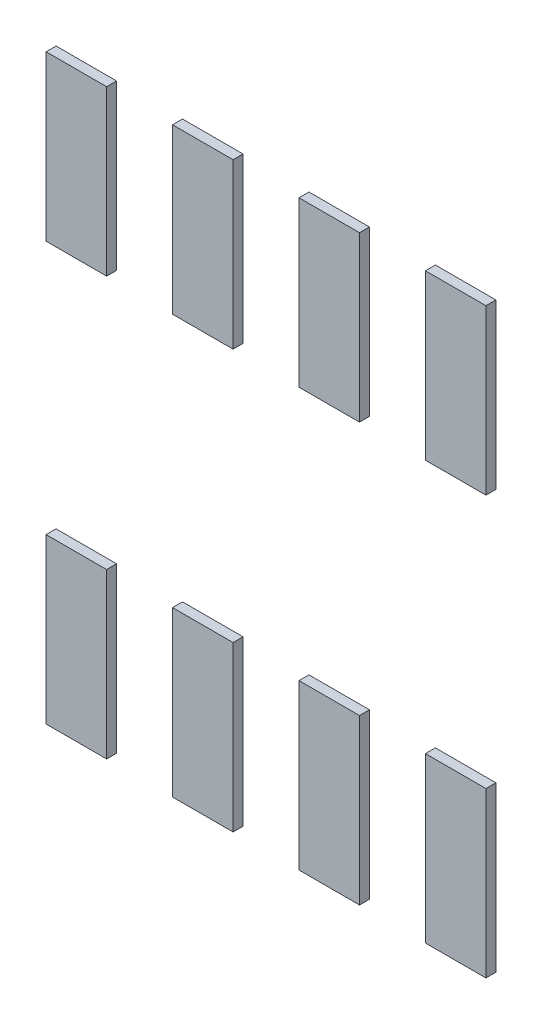
ISO-10303-21;
HEADER;
FILE_DESCRIPTION(('STEP AP214'),'2;1');
FILE_NAME('part.step','',(''),(''),'','','');
FILE_SCHEMA(('AUTOMOTIVE_DESIGN { 1 0 10303 214 1 1 1 1 }'));
ENDSEC;
DATA;
#1=APPLICATION_CONTEXT('core data for automotive mechanical design processes');
#2=APPLICATION_PROTOCOL_DEFINITION('international standard','automotive_design',2000,#1);
#3=PRODUCT_CONTEXT('',#1,'mechanical');
#4=PRODUCT('Part','Part','',(#3));
#5=PRODUCT_RELATED_PRODUCT_CATEGORY('part','',(#4));
#6=PRODUCT_DEFINITION_FORMATION('','',#4);
#7=PRODUCT_DEFINITION_CONTEXT('part definition',#1,'design');
#8=PRODUCT_DEFINITION('design','',#6,#7);
#9=PRODUCT_DEFINITION_SHAPE('','',#8);
#10=(LENGTH_UNIT() NAMED_UNIT(*) SI_UNIT(.MILLI.,.METRE.));
#11=(NAMED_UNIT(*) PLANE_ANGLE_UNIT() SI_UNIT($,.RADIAN.));
#12=(NAMED_UNIT(*) SI_UNIT($,.STERADIAN.) SOLID_ANGLE_UNIT());
#13=UNCERTAINTY_MEASURE_WITH_UNIT(LENGTH_MEASURE(1.E-05),#10,'distance_accuracy_value','');
#14=(GEOMETRIC_REPRESENTATION_CONTEXT(3) GLOBAL_UNCERTAINTY_ASSIGNED_CONTEXT((#13)) GLOBAL_UNIT_ASSIGNED_CONTEXT((#10,
#11,#12)) REPRESENTATION_CONTEXT('',''));
#15=CARTESIAN_POINT('',(0.,0.,0.));
#16=DIRECTION('',(0.,0.,1.));
#17=DIRECTION('',(1.,0.,0.));
#18=AXIS2_PLACEMENT_3D('',#15,#16,#17);
#19=CARTESIAN_POINT('',(-2.209,1.276,0.1));
#20=DIRECTION('',(0.,0.,1.));
#21=DIRECTION('',(1.,0.,0.));
#22=AXIS2_PLACEMENT_3D('',#19,#20,#21);
#23=PLANE('',#22);
#24=DIRECTION('',(0.,1.,0.));
#25=VECTOR('',#24,1.);
#26=CARTESIAN_POINT('',(-2.209,1.276,0.1));
#27=LINE('',#26,#25);
#28=CARTESIAN_POINT('',(-2.209,1.276,0.1));
#29=VERTEX_POINT('',#28);
#30=CARTESIAN_POINT('',(-2.209,2.924,0.1));
#31=VERTEX_POINT('',#30);
#32=EDGE_CURVE('P0_E88',#29,#31,#27,.T.);
#33=ORIENTED_EDGE('',*,*,#32,.F.);
#34=DIRECTION('',(1.,0.,0.));
#35=VECTOR('',#34,1.);
#36=CARTESIAN_POINT('',(-2.209,1.276,0.1));
#37=LINE('',#36,#35);
#38=CARTESIAN_POINT('',(-1.601,1.276,0.1));
#39=VERTEX_POINT('',#38);
#40=EDGE_CURVE('P0_E70',#29,#39,#37,.T.);
#41=ORIENTED_EDGE('',*,*,#40,.T.);
#42=DIRECTION('',(0.,1.,0.));
#43=VECTOR('',#42,1.);
#44=CARTESIAN_POINT('',(-1.601,1.276,0.1));
#45=LINE('',#44,#43);
#46=CARTESIAN_POINT('',(-1.601,2.924,0.1));
#47=VERTEX_POINT('',#46);
#48=EDGE_CURVE('P0_E82',#39,#47,#45,.T.);
#49=ORIENTED_EDGE('',*,*,#48,.T.);
#50=DIRECTION('',(1.,0.,0.));
#51=VECTOR('',#50,1.);
#52=CARTESIAN_POINT('',(-2.209,2.924,0.1));
#53=LINE('',#52,#51);
#54=EDGE_CURVE('P0_E11',#31,#47,#53,.T.);
#55=ORIENTED_EDGE('',*,*,#54,.F.);
#56=EDGE_LOOP('',(#33,#41,#49,#55));
#57=FACE_BOUND('',#56,.T.);
#58=ADVANCED_FACE('P0_F17',(#57),#23,.T.);
#59=CARTESIAN_POINT('',(-2.209,1.276,0.));
#60=DIRECTION('',(0.,0.,1.));
#61=DIRECTION('',(1.,0.,0.));
#62=AXIS2_PLACEMENT_3D('',#59,#60,#61);
#63=PLANE('',#62);
#64=DIRECTION('',(1.,0.,0.));
#65=VECTOR('',#64,1.);
#66=CARTESIAN_POINT('',(-2.209,2.924,0.));
#67=LINE('',#66,#65);
#68=CARTESIAN_POINT('',(-2.209,2.924,0.));
#69=VERTEX_POINT('',#68);
#70=CARTESIAN_POINT('',(-1.601,2.924,0.));
#71=VERTEX_POINT('',#70);
#72=EDGE_CURVE('P0_E25',#69,#71,#67,.T.);
#73=ORIENTED_EDGE('',*,*,#72,.T.);
#74=DIRECTION('',(0.,1.,0.));
#75=VECTOR('',#74,1.);
#76=CARTESIAN_POINT('',(-1.601,1.276,0.));
#77=LINE('',#76,#75);
#78=CARTESIAN_POINT('',(-1.601,1.276,0.));
#79=VERTEX_POINT('',#78);
#80=EDGE_CURVE('P0_E103',#79,#71,#77,.T.);
#81=ORIENTED_EDGE('',*,*,#80,.F.);
#82=DIRECTION('',(1.,0.,0.));
#83=VECTOR('',#82,1.);
#84=CARTESIAN_POINT('',(-2.209,1.276,0.));
#85=LINE('',#84,#83);
#86=CARTESIAN_POINT('',(-2.209,1.276,0.));
#87=VERTEX_POINT('',#86);
#88=EDGE_CURVE('P0_E81',#87,#79,#85,.T.);
#89=ORIENTED_EDGE('',*,*,#88,.F.);
#90=DIRECTION('',(0.,1.,0.));
#91=VECTOR('',#90,1.);
#92=CARTESIAN_POINT('',(-2.209,1.276,0.));
#93=LINE('',#92,#91);
#94=EDGE_CURVE('P0_E89',#87,#69,#93,.T.);
#95=ORIENTED_EDGE('',*,*,#94,.T.);
#96=EDGE_LOOP('',(#73,#81,#89,#95));
#97=FACE_BOUND('',#96,.T.);
#98=ADVANCED_FACE('P0_F191',(#97),#63,.F.);
#99=CARTESIAN_POINT('',(-2.209,2.924,0.));
#100=DIRECTION('',(0.,1.,0.));
#101=DIRECTION('',(1.,0.,0.));
#102=AXIS2_PLACEMENT_3D('',#99,#100,#101);
#103=PLANE('',#102);
#104=ORIENTED_EDGE('',*,*,#72,.F.);
#105=DIRECTION('',(0.,0.,1.));
#106=VECTOR('',#105,1.);
#107=CARTESIAN_POINT('',(-2.209,2.924,0.));
#108=LINE('',#107,#106);
#109=EDGE_CURVE('P0_E93',#69,#31,#108,.T.);
#110=ORIENTED_EDGE('',*,*,#109,.T.);
#111=ORIENTED_EDGE('',*,*,#54,.T.);
#112=DIRECTION('',(0.,0.,1.));
#113=VECTOR('',#112,1.);
#114=CARTESIAN_POINT('',(-1.601,2.924,0.));
#115=LINE('',#114,#113);
#116=EDGE_CURVE('P0_E107',#71,#47,#115,.T.);
#117=ORIENTED_EDGE('',*,*,#116,.F.);
#118=EDGE_LOOP('',(#104,#110,#111,#117));
#119=FACE_BOUND('',#118,.T.);
#120=ADVANCED_FACE('P0_F181',(#119),#103,.T.);
#121=CARTESIAN_POINT('',(-2.209,1.276,0.));
#122=DIRECTION('',(0.,1.,0.));
#123=DIRECTION('',(1.,0.,0.));
#124=AXIS2_PLACEMENT_3D('',#121,#122,#123);
#125=PLANE('',#124);
#126=DIRECTION('',(0.,0.,1.));
#127=VECTOR('',#126,1.);
#128=CARTESIAN_POINT('',(-1.601,1.276,0.));
#129=LINE('',#128,#127);
#130=EDGE_CURVE('P0_E76',#79,#39,#129,.T.);
#131=ORIENTED_EDGE('',*,*,#130,.T.);
#132=ORIENTED_EDGE('',*,*,#40,.F.);
#133=DIRECTION('',(0.,0.,1.));
#134=VECTOR('',#133,1.);
#135=CARTESIAN_POINT('',(-2.209,1.276,0.));
#136=LINE('',#135,#134);
#137=EDGE_CURVE('P0_E73',#87,#29,#136,.T.);
#138=ORIENTED_EDGE('',*,*,#137,.F.);
#139=ORIENTED_EDGE('',*,*,#88,.T.);
#140=EDGE_LOOP('',(#131,#132,#138,#139));
#141=FACE_BOUND('',#140,.T.);
#142=ADVANCED_FACE('P0_F72',(#141),#125,.F.);
#143=CARTESIAN_POINT('',(-1.601,1.276,0.));
#144=DIRECTION('',(1.,0.,0.));
#145=DIRECTION('',(0.,1.,0.));
#146=AXIS2_PLACEMENT_3D('',#143,#144,#145);
#147=PLANE('',#146);
#148=ORIENTED_EDGE('',*,*,#130,.F.);
#149=ORIENTED_EDGE('',*,*,#80,.T.);
#150=ORIENTED_EDGE('',*,*,#116,.T.);
#151=ORIENTED_EDGE('',*,*,#48,.F.);
#152=EDGE_LOOP('',(#148,#149,#150,#151));
#153=FACE_BOUND('',#152,.T.);
#154=ADVANCED_FACE('P0_F160',(#153),#147,.T.);
#155=CARTESIAN_POINT('',(-2.209,1.276,0.));
#156=DIRECTION('',(1.,0.,0.));
#157=DIRECTION('',(0.,1.,0.));
#158=AXIS2_PLACEMENT_3D('',#155,#156,#157);
#159=PLANE('',#158);
#160=ORIENTED_EDGE('',*,*,#32,.T.);
#161=ORIENTED_EDGE('',*,*,#109,.F.);
#162=ORIENTED_EDGE('',*,*,#94,.F.);
#163=ORIENTED_EDGE('',*,*,#137,.T.);
#164=EDGE_LOOP('',(#160,#161,#162,#163));
#165=FACE_BOUND('',#164,.T.);
#166=ADVANCED_FACE('P0_F86',(#165),#159,.F.);
#167=CLOSED_SHELL('',(#58,#98,#120,#142,#154,#166));
#168=MANIFOLD_SOLID_BREP('P0_B1',#167);
#169=CARTESIAN_POINT('',(-2.209,-2.924,0.1));
#170=DIRECTION('',(0.,0.,1.));
#171=DIRECTION('',(1.,0.,0.));
#172=AXIS2_PLACEMENT_3D('',#169,#170,#171);
#173=PLANE('',#172);
#174=DIRECTION('',(0.,1.,0.));
#175=VECTOR('',#174,1.);
#176=CARTESIAN_POINT('',(-2.209,-2.924,0.1));
#177=LINE('',#176,#175);
#178=CARTESIAN_POINT('',(-2.209,-2.924,0.1));
#179=VERTEX_POINT('',#178);
#180=CARTESIAN_POINT('',(-2.209,-1.276,0.1));
#181=VERTEX_POINT('',#180);
#182=EDGE_CURVE('P1_E88',#179,#181,#177,.T.);
#183=ORIENTED_EDGE('',*,*,#182,.F.);
#184=DIRECTION('',(1.,0.,0.));
#185=VECTOR('',#184,1.);
#186=CARTESIAN_POINT('',(-2.209,-2.924,0.1));
#187=LINE('',#186,#185);
#188=CARTESIAN_POINT('',(-1.601,-2.924,0.1));
#189=VERTEX_POINT('',#188);
#190=EDGE_CURVE('P1_E72',#179,#189,#187,.T.);
#191=ORIENTED_EDGE('',*,*,#190,.T.);
#192=DIRECTION('',(0.,1.,0.));
#193=VECTOR('',#192,1.);
#194=CARTESIAN_POINT('',(-1.601,-2.924,0.1));
#195=LINE('',#194,#193);
#196=CARTESIAN_POINT('',(-1.601,-1.276,0.1));
#197=VERTEX_POINT('',#196);
#198=EDGE_CURVE('P1_E83',#189,#197,#195,.T.);
#199=ORIENTED_EDGE('',*,*,#198,.T.);
#200=DIRECTION('',(1.,0.,0.));
#201=VECTOR('',#200,1.);
#202=CARTESIAN_POINT('',(-2.209,-1.276,0.1));
#203=LINE('',#202,#201);
#204=EDGE_CURVE('P1_E11',#181,#197,#203,.T.);
#205=ORIENTED_EDGE('',*,*,#204,.F.);
#206=EDGE_LOOP('',(#183,#191,#199,#205));
#207=FACE_BOUND('',#206,.T.);
#208=ADVANCED_FACE('P1_F17',(#207),#173,.T.);
#209=CARTESIAN_POINT('',(-2.209,-2.924,0.));
#210=DIRECTION('',(0.,0.,1.));
#211=DIRECTION('',(1.,0.,0.));
#212=AXIS2_PLACEMENT_3D('',#209,#210,#211);
#213=PLANE('',#212);
#214=DIRECTION('',(1.,0.,0.));
#215=VECTOR('',#214,1.);
#216=CARTESIAN_POINT('',(-2.209,-1.276,0.));
#217=LINE('',#216,#215);
#218=CARTESIAN_POINT('',(-2.209,-1.276,0.));
#219=VERTEX_POINT('',#218);
#220=CARTESIAN_POINT('',(-1.601,-1.276,0.));
#221=VERTEX_POINT('',#220);
#222=EDGE_CURVE('P1_E26',#219,#221,#217,.T.);
#223=ORIENTED_EDGE('',*,*,#222,.T.);
#224=DIRECTION('',(0.,1.,0.));
#225=VECTOR('',#224,1.);
#226=CARTESIAN_POINT('',(-1.601,-2.924,0.));
#227=LINE('',#226,#225);
#228=CARTESIAN_POINT('',(-1.601,-2.924,0.));
#229=VERTEX_POINT('',#228);
#230=EDGE_CURVE('P1_E107',#229,#221,#227,.T.);
#231=ORIENTED_EDGE('',*,*,#230,.F.);
#232=DIRECTION('',(1.,0.,0.));
#233=VECTOR('',#232,1.);
#234=CARTESIAN_POINT('',(-2.209,-2.924,0.));
#235=LINE('',#234,#233);
#236=CARTESIAN_POINT('',(-2.209,-2.924,0.));
#237=VERTEX_POINT('',#236);
#238=EDGE_CURVE('P1_E20',#237,#229,#235,.T.);
#239=ORIENTED_EDGE('',*,*,#238,.F.);
#240=DIRECTION('',(0.,1.,0.));
#241=VECTOR('',#240,1.);
#242=CARTESIAN_POINT('',(-2.209,-2.924,0.));
#243=LINE('',#242,#241);
#244=EDGE_CURVE('P1_E89',#237,#219,#243,.T.);
#245=ORIENTED_EDGE('',*,*,#244,.T.);
#246=EDGE_LOOP('',(#223,#231,#239,#245));
#247=FACE_BOUND('',#246,.T.);
#248=ADVANCED_FACE('P1_F121',(#247),#213,.F.);
#249=CARTESIAN_POINT('',(-2.209,-1.276,0.));
#250=DIRECTION('',(0.,1.,0.));
#251=DIRECTION('',(1.,0.,0.));
#252=AXIS2_PLACEMENT_3D('',#249,#250,#251);
#253=PLANE('',#252);
#254=ORIENTED_EDGE('',*,*,#222,.F.);
#255=DIRECTION('',(0.,0.,1.));
#256=VECTOR('',#255,1.);
#257=CARTESIAN_POINT('',(-2.209,-1.276,0.));
#258=LINE('',#257,#256);
#259=EDGE_CURVE('P1_E93',#219,#181,#258,.T.);
#260=ORIENTED_EDGE('',*,*,#259,.T.);
#261=ORIENTED_EDGE('',*,*,#204,.T.);
#262=DIRECTION('',(0.,0.,1.));
#263=VECTOR('',#262,1.);
#264=CARTESIAN_POINT('',(-1.601,-1.276,0.));
#265=LINE('',#264,#263);
#266=EDGE_CURVE('P1_E103',#221,#197,#265,.T.);
#267=ORIENTED_EDGE('',*,*,#266,.F.);
#268=EDGE_LOOP('',(#254,#260,#261,#267));
#269=FACE_BOUND('',#268,.T.);
#270=ADVANCED_FACE('P1_F120',(#269),#253,.T.);
#271=CARTESIAN_POINT('',(-2.209,-2.924,0.));
#272=DIRECTION('',(0.,1.,0.));
#273=DIRECTION('',(1.,0.,0.));
#274=AXIS2_PLACEMENT_3D('',#271,#272,#273);
#275=PLANE('',#274);
#276=DIRECTION('',(0.,0.,1.));
#277=VECTOR('',#276,1.);
#278=CARTESIAN_POINT('',(-1.601,-2.924,0.));
#279=LINE('',#278,#277);
#280=EDGE_CURVE('P1_E78',#229,#189,#279,.T.);
#281=ORIENTED_EDGE('',*,*,#280,.T.);
#282=ORIENTED_EDGE('',*,*,#190,.F.);
#283=DIRECTION('',(0.,0.,1.));
#284=VECTOR('',#283,1.);
#285=CARTESIAN_POINT('',(-2.209,-2.924,0.));
#286=LINE('',#285,#284);
#287=EDGE_CURVE('P1_E75',#237,#179,#286,.T.);
#288=ORIENTED_EDGE('',*,*,#287,.F.);
#289=ORIENTED_EDGE('',*,*,#238,.T.);
#290=EDGE_LOOP('',(#281,#282,#288,#289));
#291=FACE_BOUND('',#290,.T.);
#292=ADVANCED_FACE('P1_F74',(#291),#275,.F.);
#293=CARTESIAN_POINT('',(-1.601,-2.924,0.));
#294=DIRECTION('',(1.,0.,0.));
#295=DIRECTION('',(0.,1.,0.));
#296=AXIS2_PLACEMENT_3D('',#293,#294,#295);
#297=PLANE('',#296);
#298=ORIENTED_EDGE('',*,*,#280,.F.);
#299=ORIENTED_EDGE('',*,*,#230,.T.);
#300=ORIENTED_EDGE('',*,*,#266,.T.);
#301=ORIENTED_EDGE('',*,*,#198,.F.);
#302=EDGE_LOOP('',(#298,#299,#300,#301));
#303=FACE_BOUND('',#302,.T.);
#304=ADVANCED_FACE('P1_F119',(#303),#297,.T.);
#305=CARTESIAN_POINT('',(-2.209,-2.924,0.));
#306=DIRECTION('',(1.,0.,0.));
#307=DIRECTION('',(0.,1.,0.));
#308=AXIS2_PLACEMENT_3D('',#305,#306,#307);
#309=PLANE('',#308);
#310=ORIENTED_EDGE('',*,*,#182,.T.);
#311=ORIENTED_EDGE('',*,*,#259,.F.);
#312=ORIENTED_EDGE('',*,*,#244,.F.);
#313=ORIENTED_EDGE('',*,*,#287,.T.);
#314=EDGE_LOOP('',(#310,#311,#312,#313));
#315=FACE_BOUND('',#314,.T.);
#316=ADVANCED_FACE('P1_F86',(#315),#309,.F.);
#317=CLOSED_SHELL('',(#208,#248,#270,#292,#304,#316));
#318=MANIFOLD_SOLID_BREP('P1_B1',#317);
#319=CARTESIAN_POINT('',(-0.939,1.276,0.1));
#320=DIRECTION('',(0.,0.,1.));
#321=DIRECTION('',(1.,0.,0.));
#322=AXIS2_PLACEMENT_3D('',#319,#320,#321);
#323=PLANE('',#322);
#324=DIRECTION('',(0.,1.,0.));
#325=VECTOR('',#324,1.);
#326=CARTESIAN_POINT('',(-0.939,1.276,0.1));
#327=LINE('',#326,#325);
#328=CARTESIAN_POINT('',(-0.939,1.276,0.1));
#329=VERTEX_POINT('',#328);
#330=CARTESIAN_POINT('',(-0.939,2.924,0.1));
#331=VERTEX_POINT('',#330);
#332=EDGE_CURVE('P2_E117',#329,#331,#327,.T.);
#333=ORIENTED_EDGE('',*,*,#332,.F.);
#334=DIRECTION('',(1.,0.,0.));
#335=VECTOR('',#334,1.);
#336=CARTESIAN_POINT('',(-0.939,1.276,0.1));
#337=LINE('',#336,#335);
#338=CARTESIAN_POINT('',(-0.331,1.276,0.1));
#339=VERTEX_POINT('',#338);
#340=EDGE_CURVE('P2_E77',#329,#339,#337,.T.);
#341=ORIENTED_EDGE('',*,*,#340,.T.);
#342=DIRECTION('',(0.,1.,0.));
#343=VECTOR('',#342,1.);
#344=CARTESIAN_POINT('',(-0.331,1.276,0.1));
#345=LINE('',#344,#343);
#346=CARTESIAN_POINT('',(-0.331,2.924,0.1));
#347=VERTEX_POINT('',#346);
#348=EDGE_CURVE('P2_E89',#339,#347,#345,.T.);
#349=ORIENTED_EDGE('',*,*,#348,.T.);
#350=DIRECTION('',(1.,0.,0.));
#351=VECTOR('',#350,1.);
#352=CARTESIAN_POINT('',(-0.939,2.924,0.1));
#353=LINE('',#352,#351);
#354=EDGE_CURVE('P2_E11',#331,#347,#353,.T.);
#355=ORIENTED_EDGE('',*,*,#354,.F.);
#356=EDGE_LOOP('',(#333,#341,#349,#355));
#357=FACE_BOUND('',#356,.T.);
#358=ADVANCED_FACE('P2_F17',(#357),#323,.T.);
#359=CARTESIAN_POINT('',(-0.939,1.276,0.));
#360=DIRECTION('',(0.,0.,1.));
#361=DIRECTION('',(1.,0.,0.));
#362=AXIS2_PLACEMENT_3D('',#359,#360,#361);
#363=PLANE('',#362);
#364=DIRECTION('',(1.,0.,0.));
#365=VECTOR('',#364,1.);
#366=CARTESIAN_POINT('',(-0.939,2.924,0.));
#367=LINE('',#366,#365);
#368=CARTESIAN_POINT('',(-0.939,2.924,0.));
#369=VERTEX_POINT('',#368);
#370=CARTESIAN_POINT('',(-0.331,2.924,0.));
#371=VERTEX_POINT('',#370);
#372=EDGE_CURVE('P2_E25',#369,#371,#367,.T.);
#373=ORIENTED_EDGE('',*,*,#372,.T.);
#374=DIRECTION('',(0.,1.,0.));
#375=VECTOR('',#374,1.);
#376=CARTESIAN_POINT('',(-0.331,1.276,0.));
#377=LINE('',#376,#375);
#378=CARTESIAN_POINT('',(-0.331,1.276,0.));
#379=VERTEX_POINT('',#378);
#380=EDGE_CURVE('P2_E80',#379,#371,#377,.T.);
#381=ORIENTED_EDGE('',*,*,#380,.F.);
#382=DIRECTION('',(1.,0.,0.));
#383=VECTOR('',#382,1.);
#384=CARTESIAN_POINT('',(-0.939,1.276,0.));
#385=LINE('',#384,#383);
#386=CARTESIAN_POINT('',(-0.939,1.276,0.));
#387=VERTEX_POINT('',#386);
#388=EDGE_CURVE('P2_E68',#387,#379,#385,.T.);
#389=ORIENTED_EDGE('',*,*,#388,.F.);
#390=DIRECTION('',(0.,1.,0.));
#391=VECTOR('',#390,1.);
#392=CARTESIAN_POINT('',(-0.939,1.276,0.));
#393=LINE('',#392,#391);
#394=EDGE_CURVE('P2_E96',#387,#369,#393,.T.);
#395=ORIENTED_EDGE('',*,*,#394,.T.);
#396=EDGE_LOOP('',(#373,#381,#389,#395));
#397=FACE_BOUND('',#396,.T.);
#398=ADVANCED_FACE('P2_F81',(#397),#363,.F.);
#399=CARTESIAN_POINT('',(-0.939,2.924,0.));
#400=DIRECTION('',(0.,1.,0.));
#401=DIRECTION('',(1.,0.,0.));
#402=AXIS2_PLACEMENT_3D('',#399,#400,#401);
#403=PLANE('',#402);
#404=ORIENTED_EDGE('',*,*,#372,.F.);
#405=DIRECTION('',(0.,0.,1.));
#406=VECTOR('',#405,1.);
#407=CARTESIAN_POINT('',(-0.939,2.924,0.));
#408=LINE('',#407,#406);
#409=EDGE_CURVE('P2_E110',#369,#331,#408,.T.);
#410=ORIENTED_EDGE('',*,*,#409,.T.);
#411=ORIENTED_EDGE('',*,*,#354,.T.);
#412=DIRECTION('',(0.,0.,1.));
#413=VECTOR('',#412,1.);
#414=CARTESIAN_POINT('',(-0.331,2.924,0.));
#415=LINE('',#414,#413);
#416=EDGE_CURVE('P2_E85',#371,#347,#415,.T.);
#417=ORIENTED_EDGE('',*,*,#416,.F.);
#418=EDGE_LOOP('',(#404,#410,#411,#417));
#419=FACE_BOUND('',#418,.T.);
#420=ADVANCED_FACE('P2_F108',(#419),#403,.T.);
#421=CARTESIAN_POINT('',(-0.939,1.276,0.));
#422=DIRECTION('',(0.,1.,0.));
#423=DIRECTION('',(1.,0.,0.));
#424=AXIS2_PLACEMENT_3D('',#421,#422,#423);
#425=PLANE('',#424);
#426=DIRECTION('',(0.,0.,1.));
#427=VECTOR('',#426,1.);
#428=CARTESIAN_POINT('',(-0.331,1.276,0.));
#429=LINE('',#428,#427);
#430=EDGE_CURVE('P2_E72',#379,#339,#429,.T.);
#431=ORIENTED_EDGE('',*,*,#430,.T.);
#432=ORIENTED_EDGE('',*,*,#340,.F.);
#433=DIRECTION('',(0.,0.,1.));
#434=VECTOR('',#433,1.);
#435=CARTESIAN_POINT('',(-0.939,1.276,0.));
#436=LINE('',#435,#434);
#437=EDGE_CURVE('P2_E74',#387,#329,#436,.T.);
#438=ORIENTED_EDGE('',*,*,#437,.F.);
#439=ORIENTED_EDGE('',*,*,#388,.T.);
#440=EDGE_LOOP('',(#431,#432,#438,#439));
#441=FACE_BOUND('',#440,.T.);
#442=ADVANCED_FACE('P2_F69',(#441),#425,.F.);
#443=CARTESIAN_POINT('',(-0.331,1.276,0.));
#444=DIRECTION('',(1.,0.,0.));
#445=DIRECTION('',(0.,1.,0.));
#446=AXIS2_PLACEMENT_3D('',#443,#444,#445);
#447=PLANE('',#446);
#448=ORIENTED_EDGE('',*,*,#430,.F.);
#449=ORIENTED_EDGE('',*,*,#380,.T.);
#450=ORIENTED_EDGE('',*,*,#416,.T.);
#451=ORIENTED_EDGE('',*,*,#348,.F.);
#452=EDGE_LOOP('',(#448,#449,#450,#451));
#453=FACE_BOUND('',#452,.T.);
#454=ADVANCED_FACE('P2_F88',(#453),#447,.T.);
#455=CARTESIAN_POINT('',(-0.939,1.276,0.));
#456=DIRECTION('',(1.,0.,0.));
#457=DIRECTION('',(0.,1.,0.));
#458=AXIS2_PLACEMENT_3D('',#455,#456,#457);
#459=PLANE('',#458);
#460=ORIENTED_EDGE('',*,*,#332,.T.);
#461=ORIENTED_EDGE('',*,*,#409,.F.);
#462=ORIENTED_EDGE('',*,*,#394,.F.);
#463=ORIENTED_EDGE('',*,*,#437,.T.);
#464=EDGE_LOOP('',(#460,#461,#462,#463));
#465=FACE_BOUND('',#464,.T.);
#466=ADVANCED_FACE('P2_F116',(#465),#459,.F.);
#467=CLOSED_SHELL('',(#358,#398,#420,#442,#454,#466));
#468=MANIFOLD_SOLID_BREP('P2_B1',#467);
#469=CARTESIAN_POINT('',(-0.939,-2.924,0.1));
#470=DIRECTION('',(0.,0.,1.));
#471=DIRECTION('',(1.,0.,0.));
#472=AXIS2_PLACEMENT_3D('',#469,#470,#471);
#473=PLANE('',#472);
#474=DIRECTION('',(0.,1.,0.));
#475=VECTOR('',#474,1.);
#476=CARTESIAN_POINT('',(-0.939,-2.924,0.1));
#477=LINE('',#476,#475);
#478=CARTESIAN_POINT('',(-0.939,-2.924,0.1));
#479=VERTEX_POINT('',#478);
#480=CARTESIAN_POINT('',(-0.939,-1.276,0.1));
#481=VERTEX_POINT('',#480);
#482=EDGE_CURVE('P3_E93',#479,#481,#477,.T.);
#483=ORIENTED_EDGE('',*,*,#482,.F.);
#484=DIRECTION('',(1.,0.,0.));
#485=VECTOR('',#484,1.);
#486=CARTESIAN_POINT('',(-0.939,-2.924,0.1));
#487=LINE('',#486,#485);
#488=CARTESIAN_POINT('',(-0.331,-2.924,0.1));
#489=VERTEX_POINT('',#488);
#490=EDGE_CURVE('P3_E53',#479,#489,#487,.T.);
#491=ORIENTED_EDGE('',*,*,#490,.T.);
#492=DIRECTION('',(0.,1.,0.));
#493=VECTOR('',#492,1.);
#494=CARTESIAN_POINT('',(-0.331,-2.924,0.1));
#495=LINE('',#494,#493);
#496=CARTESIAN_POINT('',(-0.331,-1.276,0.1));
#497=VERTEX_POINT('',#496);
#498=EDGE_CURVE('P3_E103',#489,#497,#495,.T.);
#499=ORIENTED_EDGE('',*,*,#498,.T.);
#500=DIRECTION('',(1.,0.,0.));
#501=VECTOR('',#500,1.);
#502=CARTESIAN_POINT('',(-0.939,-1.276,0.1));
#503=LINE('',#502,#501);
#504=EDGE_CURVE('P3_E11',#481,#497,#503,.T.);
#505=ORIENTED_EDGE('',*,*,#504,.F.);
#506=EDGE_LOOP('',(#483,#491,#499,#505));
#507=FACE_BOUND('',#506,.T.);
#508=ADVANCED_FACE('P3_F17',(#507),#473,.T.);
#509=CARTESIAN_POINT('',(-0.939,-2.924,0.));
#510=DIRECTION('',(0.,0.,1.));
#511=DIRECTION('',(1.,0.,0.));
#512=AXIS2_PLACEMENT_3D('',#509,#510,#511);
#513=PLANE('',#512);
#514=DIRECTION('',(1.,0.,0.));
#515=VECTOR('',#514,1.);
#516=CARTESIAN_POINT('',(-0.939,-1.276,0.));
#517=LINE('',#516,#515);
#518=CARTESIAN_POINT('',(-0.939,-1.276,0.));
#519=VERTEX_POINT('',#518);
#520=CARTESIAN_POINT('',(-0.331,-1.276,0.));
#521=VERTEX_POINT('',#520);
#522=EDGE_CURVE('P3_E26',#519,#521,#517,.T.);
#523=ORIENTED_EDGE('',*,*,#522,.T.);
#524=DIRECTION('',(0.,1.,0.));
#525=VECTOR('',#524,1.);
#526=CARTESIAN_POINT('',(-0.331,-2.924,0.));
#527=LINE('',#526,#525);
#528=CARTESIAN_POINT('',(-0.331,-2.924,0.));
#529=VERTEX_POINT('',#528);
#530=EDGE_CURVE('P3_E112',#529,#521,#527,.T.);
#531=ORIENTED_EDGE('',*,*,#530,.F.);
#532=DIRECTION('',(1.,0.,0.));
#533=VECTOR('',#532,1.);
#534=CARTESIAN_POINT('',(-0.939,-2.924,0.));
#535=LINE('',#534,#533);
#536=CARTESIAN_POINT('',(-0.939,-2.924,0.));
#537=VERTEX_POINT('',#536);
#538=EDGE_CURVE('P3_E65',#537,#529,#535,.T.);
#539=ORIENTED_EDGE('',*,*,#538,.F.);
#540=DIRECTION('',(0.,1.,0.));
#541=VECTOR('',#540,1.);
#542=CARTESIAN_POINT('',(-0.939,-2.924,0.));
#543=LINE('',#542,#541);
#544=EDGE_CURVE('P3_E85',#537,#519,#543,.T.);
#545=ORIENTED_EDGE('',*,*,#544,.T.);
#546=EDGE_LOOP('',(#523,#531,#539,#545));
#547=FACE_BOUND('',#546,.T.);
#548=ADVANCED_FACE('P3_F86',(#547),#513,.F.);
#549=CARTESIAN_POINT('',(-0.939,-1.276,0.));
#550=DIRECTION('',(0.,1.,0.));
#551=DIRECTION('',(1.,0.,0.));
#552=AXIS2_PLACEMENT_3D('',#549,#550,#551);
#553=PLANE('',#552);
#554=ORIENTED_EDGE('',*,*,#522,.F.);
#555=DIRECTION('',(0.,0.,1.));
#556=VECTOR('',#555,1.);
#557=CARTESIAN_POINT('',(-0.939,-1.276,0.));
#558=LINE('',#557,#556);
#559=EDGE_CURVE('P3_E77',#519,#481,#558,.T.);
#560=ORIENTED_EDGE('',*,*,#559,.T.);
#561=ORIENTED_EDGE('',*,*,#504,.T.);
#562=DIRECTION('',(0.,0.,1.));
#563=VECTOR('',#562,1.);
#564=CARTESIAN_POINT('',(-0.331,-1.276,0.));
#565=LINE('',#564,#563);
#566=EDGE_CURVE('P3_E80',#521,#497,#565,.T.);
#567=ORIENTED_EDGE('',*,*,#566,.F.);
#568=EDGE_LOOP('',(#554,#560,#561,#567));
#569=FACE_BOUND('',#568,.T.);
#570=ADVANCED_FACE('P3_F75',(#569),#553,.T.);
#571=CARTESIAN_POINT('',(-0.939,-2.924,0.));
#572=DIRECTION('',(0.,1.,0.));
#573=DIRECTION('',(1.,0.,0.));
#574=AXIS2_PLACEMENT_3D('',#571,#572,#573);
#575=PLANE('',#574);
#576=DIRECTION('',(0.,0.,1.));
#577=VECTOR('',#576,1.);
#578=CARTESIAN_POINT('',(-0.331,-2.924,0.));
#579=LINE('',#578,#577);
#580=EDGE_CURVE('P3_E109',#529,#489,#579,.T.);
#581=ORIENTED_EDGE('',*,*,#580,.T.);
#582=ORIENTED_EDGE('',*,*,#490,.F.);
#583=DIRECTION('',(0.,0.,1.));
#584=VECTOR('',#583,1.);
#585=CARTESIAN_POINT('',(-0.939,-2.924,0.));
#586=LINE('',#585,#584);
#587=EDGE_CURVE('P3_E90',#537,#479,#586,.T.);
#588=ORIENTED_EDGE('',*,*,#587,.F.);
#589=ORIENTED_EDGE('',*,*,#538,.T.);
#590=EDGE_LOOP('',(#581,#582,#588,#589));
#591=FACE_BOUND('',#590,.T.);
#592=ADVANCED_FACE('P3_F172',(#591),#575,.F.);
#593=CARTESIAN_POINT('',(-0.331,-2.924,0.));
#594=DIRECTION('',(1.,0.,0.));
#595=DIRECTION('',(0.,1.,0.));
#596=AXIS2_PLACEMENT_3D('',#593,#594,#595);
#597=PLANE('',#596);
#598=ORIENTED_EDGE('',*,*,#580,.F.);
#599=ORIENTED_EDGE('',*,*,#530,.T.);
#600=ORIENTED_EDGE('',*,*,#566,.T.);
#601=ORIENTED_EDGE('',*,*,#498,.F.);
#602=EDGE_LOOP('',(#598,#599,#600,#601));
#603=FACE_BOUND('',#602,.T.);
#604=ADVANCED_FACE('P3_F161',(#603),#597,.T.);
#605=CARTESIAN_POINT('',(-0.939,-2.924,0.));
#606=DIRECTION('',(1.,0.,0.));
#607=DIRECTION('',(0.,1.,0.));
#608=AXIS2_PLACEMENT_3D('',#605,#606,#607);
#609=PLANE('',#608);
#610=ORIENTED_EDGE('',*,*,#482,.T.);
#611=ORIENTED_EDGE('',*,*,#559,.F.);
#612=ORIENTED_EDGE('',*,*,#544,.F.);
#613=ORIENTED_EDGE('',*,*,#587,.T.);
#614=EDGE_LOOP('',(#610,#611,#612,#613));
#615=FACE_BOUND('',#614,.T.);
#616=ADVANCED_FACE('P3_F92',(#615),#609,.F.);
#617=CLOSED_SHELL('',(#508,#548,#570,#592,#604,#616));
#618=MANIFOLD_SOLID_BREP('P3_B1',#617);
#619=CARTESIAN_POINT('',(0.331,1.276,0.1));
#620=DIRECTION('',(0.,0.,1.));
#621=DIRECTION('',(1.,0.,0.));
#622=AXIS2_PLACEMENT_3D('',#619,#620,#621);
#623=PLANE('',#622);
#624=DIRECTION('',(0.,1.,0.));
#625=VECTOR('',#624,1.);
#626=CARTESIAN_POINT('',(0.331,1.276,0.1));
#627=LINE('',#626,#625);
#628=CARTESIAN_POINT('',(0.331,1.276,0.1));
#629=VERTEX_POINT('',#628);
#630=CARTESIAN_POINT('',(0.331,2.924,0.1));
#631=VERTEX_POINT('',#630);
#632=EDGE_CURVE('P4_E98',#629,#631,#627,.T.);
#633=ORIENTED_EDGE('',*,*,#632,.F.);
#634=DIRECTION('',(1.,0.,0.));
#635=VECTOR('',#634,1.);
#636=CARTESIAN_POINT('',(0.331,1.276,0.1));
#637=LINE('',#636,#635);
#638=CARTESIAN_POINT('',(0.939,1.276,0.1));
#639=VERTEX_POINT('',#638);
#640=EDGE_CURVE('P4_E80',#629,#639,#637,.T.);
#641=ORIENTED_EDGE('',*,*,#640,.T.);
#642=DIRECTION('',(0.,1.,0.));
#643=VECTOR('',#642,1.);
#644=CARTESIAN_POINT('',(0.939,1.276,0.1));
#645=LINE('',#644,#643);
#646=CARTESIAN_POINT('',(0.939,2.924,0.1));
#647=VERTEX_POINT('',#646);
#648=EDGE_CURVE('P4_E109',#639,#647,#645,.T.);
#649=ORIENTED_EDGE('',*,*,#648,.T.);
#650=DIRECTION('',(1.,0.,0.));
#651=VECTOR('',#650,1.);
#652=CARTESIAN_POINT('',(0.331,2.924,0.1));
#653=LINE('',#652,#651);
#654=EDGE_CURVE('P4_E11',#631,#647,#653,.T.);
#655=ORIENTED_EDGE('',*,*,#654,.F.);
#656=EDGE_LOOP('',(#633,#641,#649,#655));
#657=FACE_BOUND('',#656,.T.);
#658=ADVANCED_FACE('P4_F17',(#657),#623,.T.);
#659=CARTESIAN_POINT('',(0.331,1.276,0.));
#660=DIRECTION('',(0.,0.,1.));
#661=DIRECTION('',(1.,0.,0.));
#662=AXIS2_PLACEMENT_3D('',#659,#660,#661);
#663=PLANE('',#662);
#664=DIRECTION('',(1.,0.,0.));
#665=VECTOR('',#664,1.);
#666=CARTESIAN_POINT('',(0.331,2.924,0.));
#667=LINE('',#666,#665);
#668=CARTESIAN_POINT('',(0.331,2.924,0.));
#669=VERTEX_POINT('',#668);
#670=CARTESIAN_POINT('',(0.939,2.924,0.));
#671=VERTEX_POINT('',#670);
#672=EDGE_CURVE('P4_E27',#669,#671,#667,.T.);
#673=ORIENTED_EDGE('',*,*,#672,.T.);
#674=DIRECTION('',(0.,1.,0.));
#675=VECTOR('',#674,1.);
#676=CARTESIAN_POINT('',(0.939,1.276,0.));
#677=LINE('',#676,#675);
#678=CARTESIAN_POINT('',(0.939,1.276,0.));
#679=VERTEX_POINT('',#678);
#680=EDGE_CURVE('P4_E75',#679,#671,#677,.T.);
#681=ORIENTED_EDGE('',*,*,#680,.F.);
#682=DIRECTION('',(1.,0.,0.));
#683=VECTOR('',#682,1.);
#684=CARTESIAN_POINT('',(0.331,1.276,0.));
#685=LINE('',#684,#683);
#686=CARTESIAN_POINT('',(0.331,1.276,0.));
#687=VERTEX_POINT('',#686);
#688=EDGE_CURVE('P4_E21',#687,#679,#685,.T.);
#689=ORIENTED_EDGE('',*,*,#688,.F.);
#690=DIRECTION('',(0.,1.,0.));
#691=VECTOR('',#690,1.);
#692=CARTESIAN_POINT('',(0.331,1.276,0.));
#693=LINE('',#692,#691);
#694=EDGE_CURVE('P4_E72',#687,#669,#693,.T.);
#695=ORIENTED_EDGE('',*,*,#694,.T.);
#696=EDGE_LOOP('',(#673,#681,#689,#695));
#697=FACE_BOUND('',#696,.T.);
#698=ADVANCED_FACE('P4_F19',(#697),#663,.F.);
#699=CARTESIAN_POINT('',(0.331,2.924,0.));
#700=DIRECTION('',(0.,1.,0.));
#701=DIRECTION('',(1.,0.,0.));
#702=AXIS2_PLACEMENT_3D('',#699,#700,#701);
#703=PLANE('',#702);
#704=ORIENTED_EDGE('',*,*,#672,.F.);
#705=DIRECTION('',(0.,0.,1.));
#706=VECTOR('',#705,1.);
#707=CARTESIAN_POINT('',(0.331,2.924,0.));
#708=LINE('',#707,#706);
#709=EDGE_CURVE('P4_E91',#669,#631,#708,.T.);
#710=ORIENTED_EDGE('',*,*,#709,.T.);
#711=ORIENTED_EDGE('',*,*,#654,.T.);
#712=DIRECTION('',(0.,0.,1.));
#713=VECTOR('',#712,1.);
#714=CARTESIAN_POINT('',(0.939,2.924,0.));
#715=LINE('',#714,#713);
#716=EDGE_CURVE('P4_E106',#671,#647,#715,.T.);
#717=ORIENTED_EDGE('',*,*,#716,.F.);
#718=EDGE_LOOP('',(#704,#710,#711,#717));
#719=FACE_BOUND('',#718,.T.);
#720=ADVANCED_FACE('P4_F119',(#719),#703,.T.);
#721=CARTESIAN_POINT('',(0.331,1.276,0.));
#722=DIRECTION('',(0.,1.,0.));
#723=DIRECTION('',(1.,0.,0.));
#724=AXIS2_PLACEMENT_3D('',#721,#722,#723);
#725=PLANE('',#724);
#726=DIRECTION('',(0.,0.,1.));
#727=VECTOR('',#726,1.);
#728=CARTESIAN_POINT('',(0.939,1.276,0.));
#729=LINE('',#728,#727);
#730=EDGE_CURVE('P4_E88',#679,#639,#729,.T.);
#731=ORIENTED_EDGE('',*,*,#730,.T.);
#732=ORIENTED_EDGE('',*,*,#640,.F.);
#733=DIRECTION('',(0.,0.,1.));
#734=VECTOR('',#733,1.);
#735=CARTESIAN_POINT('',(0.331,1.276,0.));
#736=LINE('',#735,#734);
#737=EDGE_CURVE('P4_E82',#687,#629,#736,.T.);
#738=ORIENTED_EDGE('',*,*,#737,.F.);
#739=ORIENTED_EDGE('',*,*,#688,.T.);
#740=EDGE_LOOP('',(#731,#732,#738,#739));
#741=FACE_BOUND('',#740,.T.);
#742=ADVANCED_FACE('P4_F83',(#741),#725,.F.);
#743=CARTESIAN_POINT('',(0.939,1.276,0.));
#744=DIRECTION('',(1.,0.,0.));
#745=DIRECTION('',(0.,1.,0.));
#746=AXIS2_PLACEMENT_3D('',#743,#744,#745);
#747=PLANE('',#746);
#748=ORIENTED_EDGE('',*,*,#730,.F.);
#749=ORIENTED_EDGE('',*,*,#680,.T.);
#750=ORIENTED_EDGE('',*,*,#716,.T.);
#751=ORIENTED_EDGE('',*,*,#648,.F.);
#752=EDGE_LOOP('',(#748,#749,#750,#751));
#753=FACE_BOUND('',#752,.T.);
#754=ADVANCED_FACE('P4_F118',(#753),#747,.T.);
#755=CARTESIAN_POINT('',(0.331,1.276,0.));
#756=DIRECTION('',(1.,0.,0.));
#757=DIRECTION('',(0.,1.,0.));
#758=AXIS2_PLACEMENT_3D('',#755,#756,#757);
#759=PLANE('',#758);
#760=ORIENTED_EDGE('',*,*,#632,.T.);
#761=ORIENTED_EDGE('',*,*,#709,.F.);
#762=ORIENTED_EDGE('',*,*,#694,.F.);
#763=ORIENTED_EDGE('',*,*,#737,.T.);
#764=EDGE_LOOP('',(#760,#761,#762,#763));
#765=FACE_BOUND('',#764,.T.);
#766=ADVANCED_FACE('P4_F90',(#765),#759,.F.);
#767=CLOSED_SHELL('',(#658,#698,#720,#742,#754,#766));
#768=MANIFOLD_SOLID_BREP('P4_B1',#767);
#769=CARTESIAN_POINT('',(0.331,-2.924,0.1));
#770=DIRECTION('',(0.,0.,1.));
#771=DIRECTION('',(1.,0.,0.));
#772=AXIS2_PLACEMENT_3D('',#769,#770,#771);
#773=PLANE('',#772);
#774=DIRECTION('',(0.,1.,0.));
#775=VECTOR('',#774,1.);
#776=CARTESIAN_POINT('',(0.331,-2.924,0.1));
#777=LINE('',#776,#775);
#778=CARTESIAN_POINT('',(0.331,-2.924,0.1));
#779=VERTEX_POINT('',#778);
#780=CARTESIAN_POINT('',(0.331,-1.276,0.1));
#781=VERTEX_POINT('',#780);
#782=EDGE_CURVE('P5_E69',#779,#781,#777,.T.);
#783=ORIENTED_EDGE('',*,*,#782,.F.);
#784=DIRECTION('',(1.,0.,0.));
#785=VECTOR('',#784,1.);
#786=CARTESIAN_POINT('',(0.331,-2.924,0.1));
#787=LINE('',#786,#785);
#788=CARTESIAN_POINT('',(0.939,-2.924,0.1));
#789=VERTEX_POINT('',#788);
#790=EDGE_CURVE('P5_E63',#779,#789,#787,.T.);
#791=ORIENTED_EDGE('',*,*,#790,.T.);
#792=DIRECTION('',(0.,1.,0.));
#793=VECTOR('',#792,1.);
#794=CARTESIAN_POINT('',(0.939,-2.924,0.1));
#795=LINE('',#794,#793);
#796=CARTESIAN_POINT('',(0.939,-1.276,0.1));
#797=VERTEX_POINT('',#796);
#798=EDGE_CURVE('P5_E65',#789,#797,#795,.T.);
#799=ORIENTED_EDGE('',*,*,#798,.T.);
#800=DIRECTION('',(1.,0.,0.));
#801=VECTOR('',#800,1.);
#802=CARTESIAN_POINT('',(0.331,-1.276,0.1));
#803=LINE('',#802,#801);
#804=EDGE_CURVE('P5_E11',#781,#797,#803,.T.);
#805=ORIENTED_EDGE('',*,*,#804,.F.);
#806=EDGE_LOOP('',(#783,#791,#799,#805));
#807=FACE_BOUND('',#806,.T.);
#808=ADVANCED_FACE('P5_F17',(#807),#773,.T.);
#809=CARTESIAN_POINT('',(0.331,-2.924,0.));
#810=DIRECTION('',(0.,0.,1.));
#811=DIRECTION('',(1.,0.,0.));
#812=AXIS2_PLACEMENT_3D('',#809,#810,#811);
#813=PLANE('',#812);
#814=DIRECTION('',(1.,0.,0.));
#815=VECTOR('',#814,1.);
#816=CARTESIAN_POINT('',(0.331,-1.276,0.));
#817=LINE('',#816,#815);
#818=CARTESIAN_POINT('',(0.331,-1.276,0.));
#819=VERTEX_POINT('',#818);
#820=CARTESIAN_POINT('',(0.939,-1.276,0.));
#821=VERTEX_POINT('',#820);
#822=EDGE_CURVE('P5_E21',#819,#821,#817,.T.);
#823=ORIENTED_EDGE('',*,*,#822,.T.);
#824=DIRECTION('',(0.,1.,0.));
#825=VECTOR('',#824,1.);
#826=CARTESIAN_POINT('',(0.939,-2.924,0.));
#827=LINE('',#826,#825);
#828=CARTESIAN_POINT('',(0.939,-2.924,0.));
#829=VERTEX_POINT('',#828);
#830=EDGE_CURVE('P5_E88',#829,#821,#827,.T.);
#831=ORIENTED_EDGE('',*,*,#830,.F.);
#832=DIRECTION('',(1.,0.,0.));
#833=VECTOR('',#832,1.);
#834=CARTESIAN_POINT('',(0.331,-2.924,0.));
#835=LINE('',#834,#833);
#836=CARTESIAN_POINT('',(0.331,-2.924,0.));
#837=VERTEX_POINT('',#836);
#838=EDGE_CURVE('P5_E75',#837,#829,#835,.T.);
#839=ORIENTED_EDGE('',*,*,#838,.F.);
#840=DIRECTION('',(0.,1.,0.));
#841=VECTOR('',#840,1.);
#842=CARTESIAN_POINT('',(0.331,-2.924,0.));
#843=LINE('',#842,#841);
#844=EDGE_CURVE('P5_E97',#837,#819,#843,.T.);
#845=ORIENTED_EDGE('',*,*,#844,.T.);
#846=EDGE_LOOP('',(#823,#831,#839,#845));
#847=FACE_BOUND('',#846,.T.);
#848=ADVANCED_FACE('P5_F19',(#847),#813,.F.);
#849=CARTESIAN_POINT('',(0.331,-1.276,0.));
#850=DIRECTION('',(0.,1.,0.));
#851=DIRECTION('',(1.,0.,0.));
#852=AXIS2_PLACEMENT_3D('',#849,#850,#851);
#853=PLANE('',#852);
#854=ORIENTED_EDGE('',*,*,#822,.F.);
#855=DIRECTION('',(0.,0.,1.));
#856=VECTOR('',#855,1.);
#857=CARTESIAN_POINT('',(0.331,-1.276,0.));
#858=LINE('',#857,#856);
#859=EDGE_CURVE('P5_E182',#819,#781,#858,.T.);
#860=ORIENTED_EDGE('',*,*,#859,.T.);
#861=ORIENTED_EDGE('',*,*,#804,.T.);
#862=DIRECTION('',(0.,0.,1.));
#863=VECTOR('',#862,1.);
#864=CARTESIAN_POINT('',(0.939,-1.276,0.));
#865=LINE('',#864,#863);
#866=EDGE_CURVE('P5_E82',#821,#797,#865,.T.);
#867=ORIENTED_EDGE('',*,*,#866,.F.);
#868=EDGE_LOOP('',(#854,#860,#861,#867));
#869=FACE_BOUND('',#868,.T.);
#870=ADVANCED_FACE('P5_F112',(#869),#853,.T.);
#871=CARTESIAN_POINT('',(0.331,-2.924,0.));
#872=DIRECTION('',(0.,1.,0.));
#873=DIRECTION('',(1.,0.,0.));
#874=AXIS2_PLACEMENT_3D('',#871,#872,#873);
#875=PLANE('',#874);
#876=DIRECTION('',(0.,0.,1.));
#877=VECTOR('',#876,1.);
#878=CARTESIAN_POINT('',(0.939,-2.924,0.));
#879=LINE('',#878,#877);
#880=EDGE_CURVE('P5_E81',#829,#789,#879,.T.);
#881=ORIENTED_EDGE('',*,*,#880,.T.);
#882=ORIENTED_EDGE('',*,*,#790,.F.);
#883=DIRECTION('',(0.,0.,1.));
#884=VECTOR('',#883,1.);
#885=CARTESIAN_POINT('',(0.331,-2.924,0.));
#886=LINE('',#885,#884);
#887=EDGE_CURVE('P5_E89',#837,#779,#886,.T.);
#888=ORIENTED_EDGE('',*,*,#887,.F.);
#889=ORIENTED_EDGE('',*,*,#838,.T.);
#890=EDGE_LOOP('',(#881,#882,#888,#889));
#891=FACE_BOUND('',#890,.T.);
#892=ADVANCED_FACE('P5_F85',(#891),#875,.F.);
#893=CARTESIAN_POINT('',(0.939,-2.924,0.));
#894=DIRECTION('',(1.,0.,0.));
#895=DIRECTION('',(0.,1.,0.));
#896=AXIS2_PLACEMENT_3D('',#893,#894,#895);
#897=PLANE('',#896);
#898=ORIENTED_EDGE('',*,*,#880,.F.);
#899=ORIENTED_EDGE('',*,*,#830,.T.);
#900=ORIENTED_EDGE('',*,*,#866,.T.);
#901=ORIENTED_EDGE('',*,*,#798,.F.);
#902=EDGE_LOOP('',(#898,#899,#900,#901));
#903=FACE_BOUND('',#902,.T.);
#904=ADVANCED_FACE('P5_F79',(#903),#897,.T.);
#905=CARTESIAN_POINT('',(0.331,-2.924,0.));
#906=DIRECTION('',(1.,0.,0.));
#907=DIRECTION('',(0.,1.,0.));
#908=AXIS2_PLACEMENT_3D('',#905,#906,#907);
#909=PLANE('',#908);
#910=ORIENTED_EDGE('',*,*,#782,.T.);
#911=ORIENTED_EDGE('',*,*,#859,.F.);
#912=ORIENTED_EDGE('',*,*,#844,.F.);
#913=ORIENTED_EDGE('',*,*,#887,.T.);
#914=EDGE_LOOP('',(#910,#911,#912,#913));
#915=FACE_BOUND('',#914,.T.);
#916=ADVANCED_FACE('P5_F157',(#915),#909,.F.);
#917=CLOSED_SHELL('',(#808,#848,#870,#892,#904,#916));
#918=MANIFOLD_SOLID_BREP('P5_B1',#917);
#919=CARTESIAN_POINT('',(1.601,1.276,0.1));
#920=DIRECTION('',(0.,0.,1.));
#921=DIRECTION('',(1.,0.,0.));
#922=AXIS2_PLACEMENT_3D('',#919,#920,#921);
#923=PLANE('',#922);
#924=DIRECTION('',(0.,1.,0.));
#925=VECTOR('',#924,1.);
#926=CARTESIAN_POINT('',(1.601,1.276,0.1));
#927=LINE('',#926,#925);
#928=CARTESIAN_POINT('',(1.601,1.276,0.1));
#929=VERTEX_POINT('',#928);
#930=CARTESIAN_POINT('',(1.601,2.924,0.1));
#931=VERTEX_POINT('',#930);
#932=EDGE_CURVE('P6_E88',#929,#931,#927,.T.);
#933=ORIENTED_EDGE('',*,*,#932,.F.);
#934=DIRECTION('',(1.,0.,0.));
#935=VECTOR('',#934,1.);
#936=CARTESIAN_POINT('',(1.601,1.276,0.1));
#937=LINE('',#936,#935);
#938=CARTESIAN_POINT('',(2.209,1.276,0.1));
#939=VERTEX_POINT('',#938);
#940=EDGE_CURVE('P6_E70',#929,#939,#937,.T.);
#941=ORIENTED_EDGE('',*,*,#940,.T.);
#942=DIRECTION('',(0.,1.,0.));
#943=VECTOR('',#942,1.);
#944=CARTESIAN_POINT('',(2.209,1.276,0.1));
#945=LINE('',#944,#943);
#946=CARTESIAN_POINT('',(2.209,2.924,0.1));
#947=VERTEX_POINT('',#946);
#948=EDGE_CURVE('P6_E82',#939,#947,#945,.T.);
#949=ORIENTED_EDGE('',*,*,#948,.T.);
#950=DIRECTION('',(1.,0.,0.));
#951=VECTOR('',#950,1.);
#952=CARTESIAN_POINT('',(1.601,2.924,0.1));
#953=LINE('',#952,#951);
#954=EDGE_CURVE('P6_E11',#931,#947,#953,.T.);
#955=ORIENTED_EDGE('',*,*,#954,.F.);
#956=EDGE_LOOP('',(#933,#941,#949,#955));
#957=FACE_BOUND('',#956,.T.);
#958=ADVANCED_FACE('P6_F17',(#957),#923,.T.);
#959=CARTESIAN_POINT('',(1.601,1.276,0.));
#960=DIRECTION('',(0.,0.,1.));
#961=DIRECTION('',(1.,0.,0.));
#962=AXIS2_PLACEMENT_3D('',#959,#960,#961);
#963=PLANE('',#962);
#964=DIRECTION('',(1.,0.,0.));
#965=VECTOR('',#964,1.);
#966=CARTESIAN_POINT('',(1.601,2.924,0.));
#967=LINE('',#966,#965);
#968=CARTESIAN_POINT('',(1.601,2.924,0.));
#969=VERTEX_POINT('',#968);
#970=CARTESIAN_POINT('',(2.209,2.924,0.));
#971=VERTEX_POINT('',#970);
#972=EDGE_CURVE('P6_E25',#969,#971,#967,.T.);
#973=ORIENTED_EDGE('',*,*,#972,.T.);
#974=DIRECTION('',(0.,1.,0.));
#975=VECTOR('',#974,1.);
#976=CARTESIAN_POINT('',(2.209,1.276,0.));
#977=LINE('',#976,#975);
#978=CARTESIAN_POINT('',(2.209,1.276,0.));
#979=VERTEX_POINT('',#978);
#980=EDGE_CURVE('P6_E105',#979,#971,#977,.T.);
#981=ORIENTED_EDGE('',*,*,#980,.F.);
#982=DIRECTION('',(1.,0.,0.));
#983=VECTOR('',#982,1.);
#984=CARTESIAN_POINT('',(1.601,1.276,0.));
#985=LINE('',#984,#983);
#986=CARTESIAN_POINT('',(1.601,1.276,0.));
#987=VERTEX_POINT('',#986);
#988=EDGE_CURVE('P6_E81',#987,#979,#985,.T.);
#989=ORIENTED_EDGE('',*,*,#988,.F.);
#990=DIRECTION('',(0.,1.,0.));
#991=VECTOR('',#990,1.);
#992=CARTESIAN_POINT('',(1.601,1.276,0.));
#993=LINE('',#992,#991);
#994=EDGE_CURVE('P6_E89',#987,#969,#993,.T.);
#995=ORIENTED_EDGE('',*,*,#994,.T.);
#996=EDGE_LOOP('',(#973,#981,#989,#995));
#997=FACE_BOUND('',#996,.T.);
#998=ADVANCED_FACE('P6_F119',(#997),#963,.F.);
#999=CARTESIAN_POINT('',(1.601,2.924,0.));
#1000=DIRECTION('',(0.,1.,0.));
#1001=DIRECTION('',(1.,0.,0.));
#1002=AXIS2_PLACEMENT_3D('',#999,#1000,#1001);
#1003=PLANE('',#1002);
#1004=ORIENTED_EDGE('',*,*,#972,.F.);
#1005=DIRECTION('',(0.,0.,1.));
#1006=VECTOR('',#1005,1.);
#1007=CARTESIAN_POINT('',(1.601,2.924,0.));
#1008=LINE('',#1007,#1006);
#1009=EDGE_CURVE('P6_E93',#969,#931,#1008,.T.);
#1010=ORIENTED_EDGE('',*,*,#1009,.T.);
#1011=ORIENTED_EDGE('',*,*,#954,.T.);
#1012=DIRECTION('',(0.,0.,1.));
#1013=VECTOR('',#1012,1.);
#1014=CARTESIAN_POINT('',(2.209,2.924,0.));
#1015=LINE('',#1014,#1013);
#1016=EDGE_CURVE('P6_E109',#971,#947,#1015,.T.);
#1017=ORIENTED_EDGE('',*,*,#1016,.F.);
#1018=EDGE_LOOP('',(#1004,#1010,#1011,#1017));
#1019=FACE_BOUND('',#1018,.T.);
#1020=ADVANCED_FACE('P6_F122',(#1019),#1003,.T.);
#1021=CARTESIAN_POINT('',(1.601,1.276,0.));
#1022=DIRECTION('',(0.,1.,0.));
#1023=DIRECTION('',(1.,0.,0.));
#1024=AXIS2_PLACEMENT_3D('',#1021,#1022,#1023);
#1025=PLANE('',#1024);
#1026=DIRECTION('',(0.,0.,1.));
#1027=VECTOR('',#1026,1.);
#1028=CARTESIAN_POINT('',(2.209,1.276,0.));
#1029=LINE('',#1028,#1027);
#1030=EDGE_CURVE('P6_E76',#979,#939,#1029,.T.);
#1031=ORIENTED_EDGE('',*,*,#1030,.T.);
#1032=ORIENTED_EDGE('',*,*,#940,.F.);
#1033=DIRECTION('',(0.,0.,1.));
#1034=VECTOR('',#1033,1.);
#1035=CARTESIAN_POINT('',(1.601,1.276,0.));
#1036=LINE('',#1035,#1034);
#1037=EDGE_CURVE('P6_E73',#987,#929,#1036,.T.);
#1038=ORIENTED_EDGE('',*,*,#1037,.F.);
#1039=ORIENTED_EDGE('',*,*,#988,.T.);
#1040=EDGE_LOOP('',(#1031,#1032,#1038,#1039));
#1041=FACE_BOUND('',#1040,.T.);
#1042=ADVANCED_FACE('P6_F72',(#1041),#1025,.F.);
#1043=CARTESIAN_POINT('',(2.209,1.276,0.));
#1044=DIRECTION('',(1.,0.,0.));
#1045=DIRECTION('',(0.,1.,0.));
#1046=AXIS2_PLACEMENT_3D('',#1043,#1044,#1045);
#1047=PLANE('',#1046);
#1048=ORIENTED_EDGE('',*,*,#1030,.F.);
#1049=ORIENTED_EDGE('',*,*,#980,.T.);
#1050=ORIENTED_EDGE('',*,*,#1016,.T.);
#1051=ORIENTED_EDGE('',*,*,#948,.F.);
#1052=EDGE_LOOP('',(#1048,#1049,#1050,#1051));
#1053=FACE_BOUND('',#1052,.T.);
#1054=ADVANCED_FACE('P6_F121',(#1053),#1047,.T.);
#1055=CARTESIAN_POINT('',(1.601,1.276,0.));
#1056=DIRECTION('',(1.,0.,0.));
#1057=DIRECTION('',(0.,1.,0.));
#1058=AXIS2_PLACEMENT_3D('',#1055,#1056,#1057);
#1059=PLANE('',#1058);
#1060=ORIENTED_EDGE('',*,*,#932,.T.);
#1061=ORIENTED_EDGE('',*,*,#1009,.F.);
#1062=ORIENTED_EDGE('',*,*,#994,.F.);
#1063=ORIENTED_EDGE('',*,*,#1037,.T.);
#1064=EDGE_LOOP('',(#1060,#1061,#1062,#1063));
#1065=FACE_BOUND('',#1064,.T.);
#1066=ADVANCED_FACE('P6_F86',(#1065),#1059,.F.);
#1067=CLOSED_SHELL('',(#958,#998,#1020,#1042,#1054,#1066));
#1068=MANIFOLD_SOLID_BREP('P6_B1',#1067);
#1069=CARTESIAN_POINT('',(1.601,-2.924,0.1));
#1070=DIRECTION('',(0.,0.,1.));
#1071=DIRECTION('',(1.,0.,0.));
#1072=AXIS2_PLACEMENT_3D('',#1069,#1070,#1071);
#1073=PLANE('',#1072);
#1074=DIRECTION('',(0.,1.,0.));
#1075=VECTOR('',#1074,1.);
#1076=CARTESIAN_POINT('',(1.601,-2.924,0.1));
#1077=LINE('',#1076,#1075);
#1078=CARTESIAN_POINT('',(1.601,-2.924,0.1));
#1079=VERTEX_POINT('',#1078);
#1080=CARTESIAN_POINT('',(1.601,-1.276,0.1));
#1081=VERTEX_POINT('',#1080);
#1082=EDGE_CURVE('P7_E97',#1079,#1081,#1077,.T.);
#1083=ORIENTED_EDGE('',*,*,#1082,.F.);
#1084=DIRECTION('',(1.,0.,0.));
#1085=VECTOR('',#1084,1.);
#1086=CARTESIAN_POINT('',(1.601,-2.924,0.1));
#1087=LINE('',#1086,#1085);
#1088=CARTESIAN_POINT('',(2.209,-2.924,0.1));
#1089=VERTEX_POINT('',#1088);
#1090=EDGE_CURVE('P7_E76',#1079,#1089,#1087,.T.);
#1091=ORIENTED_EDGE('',*,*,#1090,.T.);
#1092=DIRECTION('',(0.,1.,0.));
#1093=VECTOR('',#1092,1.);
#1094=CARTESIAN_POINT('',(2.209,-2.924,0.1));
#1095=LINE('',#1094,#1093);
#1096=CARTESIAN_POINT('',(2.209,-1.276,0.1));
#1097=VERTEX_POINT('',#1096);
#1098=EDGE_CURVE('P7_E87',#1089,#1097,#1095,.T.);
#1099=ORIENTED_EDGE('',*,*,#1098,.T.);
#1100=DIRECTION('',(1.,0.,0.));
#1101=VECTOR('',#1100,1.);
#1102=CARTESIAN_POINT('',(1.601,-1.276,0.1));
#1103=LINE('',#1102,#1101);
#1104=EDGE_CURVE('P7_E11',#1081,#1097,#1103,.T.);
#1105=ORIENTED_EDGE('',*,*,#1104,.F.);
#1106=EDGE_LOOP('',(#1083,#1091,#1099,#1105));
#1107=FACE_BOUND('',#1106,.T.);
#1108=ADVANCED_FACE('P7_F17',(#1107),#1073,.T.);
#1109=CARTESIAN_POINT('',(1.601,-2.924,0.));
#1110=DIRECTION('',(0.,0.,1.));
#1111=DIRECTION('',(1.,0.,0.));
#1112=AXIS2_PLACEMENT_3D('',#1109,#1110,#1111);
#1113=PLANE('',#1112);
#1114=DIRECTION('',(1.,0.,0.));
#1115=VECTOR('',#1114,1.);
#1116=CARTESIAN_POINT('',(1.601,-1.276,0.));
#1117=LINE('',#1116,#1115);
#1118=CARTESIAN_POINT('',(1.601,-1.276,0.));
#1119=VERTEX_POINT('',#1118);
#1120=CARTESIAN_POINT('',(2.209,-1.276,0.));
#1121=VERTEX_POINT('',#1120);
#1122=EDGE_CURVE('P7_E26',#1119,#1121,#1117,.T.);
#1123=ORIENTED_EDGE('',*,*,#1122,.T.);
#1124=DIRECTION('',(0.,1.,0.));
#1125=VECTOR('',#1124,1.);
#1126=CARTESIAN_POINT('',(2.209,-2.924,0.));
#1127=LINE('',#1126,#1125);
#1128=CARTESIAN_POINT('',(2.209,-2.924,0.));
#1129=VERTEX_POINT('',#1128);
#1130=EDGE_CURVE('P7_E79',#1129,#1121,#1127,.T.);
#1131=ORIENTED_EDGE('',*,*,#1130,.F.);
#1132=DIRECTION('',(1.,0.,0.));
#1133=VECTOR('',#1132,1.);
#1134=CARTESIAN_POINT('',(1.601,-2.924,0.));
#1135=LINE('',#1134,#1133);
#1136=CARTESIAN_POINT('',(1.601,-2.924,0.));
#1137=VERTEX_POINT('',#1136);
#1138=EDGE_CURVE('P7_E67',#1137,#1129,#1135,.T.);
#1139=ORIENTED_EDGE('',*,*,#1138,.F.);
#1140=DIRECTION('',(0.,1.,0.));
#1141=VECTOR('',#1140,1.);
#1142=CARTESIAN_POINT('',(1.601,-2.924,0.));
#1143=LINE('',#1142,#1141);
#1144=EDGE_CURVE('P7_E94',#1137,#1119,#1143,.T.);
#1145=ORIENTED_EDGE('',*,*,#1144,.T.);
#1146=EDGE_LOOP('',(#1123,#1131,#1139,#1145));
#1147=FACE_BOUND('',#1146,.T.);
#1148=ADVANCED_FACE('P7_F19',(#1147),#1113,.F.);
#1149=CARTESIAN_POINT('',(1.601,-1.276,0.));
#1150=DIRECTION('',(0.,1.,0.));
#1151=DIRECTION('',(1.,0.,0.));
#1152=AXIS2_PLACEMENT_3D('',#1149,#1150,#1151);
#1153=PLANE('',#1152);
#1154=ORIENTED_EDGE('',*,*,#1122,.F.);
#1155=DIRECTION('',(0.,0.,1.));
#1156=VECTOR('',#1155,1.);
#1157=CARTESIAN_POINT('',(1.601,-1.276,0.));
#1158=LINE('',#1157,#1156);
#1159=EDGE_CURVE('P7_E101',#1119,#1081,#1158,.T.);
#1160=ORIENTED_EDGE('',*,*,#1159,.T.);
#1161=ORIENTED_EDGE('',*,*,#1104,.T.);
#1162=DIRECTION('',(0.,0.,1.));
#1163=VECTOR('',#1162,1.);
#1164=CARTESIAN_POINT('',(2.209,-1.276,0.));
#1165=LINE('',#1164,#1163);
#1166=EDGE_CURVE('P7_E83',#1121,#1097,#1165,.T.);
#1167=ORIENTED_EDGE('',*,*,#1166,.F.);
#1168=EDGE_LOOP('',(#1154,#1160,#1161,#1167));
#1169=FACE_BOUND('',#1168,.T.);
#1170=ADVANCED_FACE('P7_F178',(#1169),#1153,.T.);
#1171=CARTESIAN_POINT('',(1.601,-2.924,0.));
#1172=DIRECTION('',(0.,1.,0.));
#1173=DIRECTION('',(1.,0.,0.));
#1174=AXIS2_PLACEMENT_3D('',#1171,#1172,#1173);
#1175=PLANE('',#1174);
#1176=DIRECTION('',(0.,0.,1.));
#1177=VECTOR('',#1176,1.);
#1178=CARTESIAN_POINT('',(2.209,-2.924,0.));
#1179=LINE('',#1178,#1177);
#1180=EDGE_CURVE('P7_E71',#1129,#1089,#1179,.T.);
#1181=ORIENTED_EDGE('',*,*,#1180,.T.);
#1182=ORIENTED_EDGE('',*,*,#1090,.F.);
#1183=DIRECTION('',(0.,0.,1.));
#1184=VECTOR('',#1183,1.);
#1185=CARTESIAN_POINT('',(1.601,-2.924,0.));
#1186=LINE('',#1185,#1184);
#1187=EDGE_CURVE('P7_E73',#1137,#1079,#1186,.T.);
#1188=ORIENTED_EDGE('',*,*,#1187,.F.);
#1189=ORIENTED_EDGE('',*,*,#1138,.T.);
#1190=EDGE_LOOP('',(#1181,#1182,#1188,#1189));
#1191=FACE_BOUND('',#1190,.T.);
#1192=ADVANCED_FACE('P7_F68',(#1191),#1175,.F.);
#1193=CARTESIAN_POINT('',(2.209,-2.924,0.));
#1194=DIRECTION('',(1.,0.,0.));
#1195=DIRECTION('',(0.,1.,0.));
#1196=AXIS2_PLACEMENT_3D('',#1193,#1194,#1195);
#1197=PLANE('',#1196);
#1198=ORIENTED_EDGE('',*,*,#1180,.F.);
#1199=ORIENTED_EDGE('',*,*,#1130,.T.);
#1200=ORIENTED_EDGE('',*,*,#1166,.T.);
#1201=ORIENTED_EDGE('',*,*,#1098,.F.);
#1202=EDGE_LOOP('',(#1198,#1199,#1200,#1201));
#1203=FACE_BOUND('',#1202,.T.);
#1204=ADVANCED_FACE('P7_F86',(#1203),#1197,.T.);
#1205=CARTESIAN_POINT('',(1.601,-2.924,0.));
#1206=DIRECTION('',(1.,0.,0.));
#1207=DIRECTION('',(0.,1.,0.));
#1208=AXIS2_PLACEMENT_3D('',#1205,#1206,#1207);
#1209=PLANE('',#1208);
#1210=ORIENTED_EDGE('',*,*,#1082,.T.);
#1211=ORIENTED_EDGE('',*,*,#1159,.F.);
#1212=ORIENTED_EDGE('',*,*,#1144,.F.);
#1213=ORIENTED_EDGE('',*,*,#1187,.T.);
#1214=EDGE_LOOP('',(#1210,#1211,#1212,#1213));
#1215=FACE_BOUND('',#1214,.T.);
#1216=ADVANCED_FACE('P7_F151',(#1215),#1209,.F.);
#1217=CLOSED_SHELL('',(#1108,#1148,#1170,#1192,#1204,#1216));
#1218=MANIFOLD_SOLID_BREP('P7_B1',#1217);
#1219=ADVANCED_BREP_SHAPE_REPRESENTATION('',(#18,#168,#318,#468,#618,#768,#918,#1068,#1218),#14);
#1220=SHAPE_DEFINITION_REPRESENTATION(#9,#1219);
ENDSEC;
END-ISO-10303-21;
